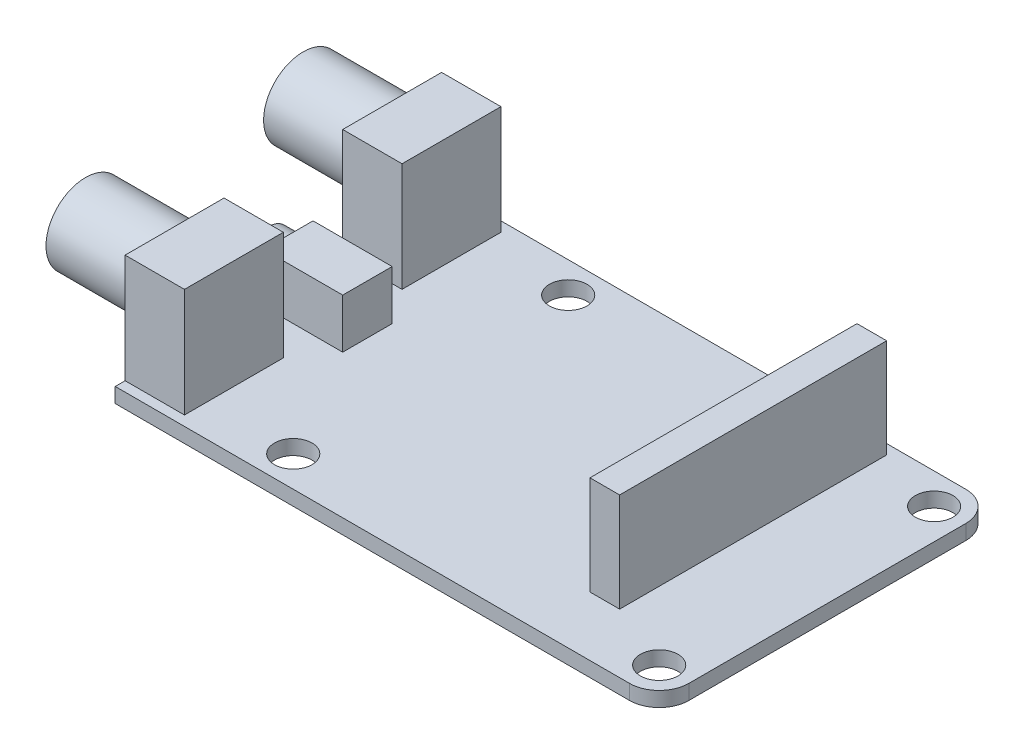
ISO-10303-21;
HEADER;
FILE_DESCRIPTION(('STEP AP214'),'2;1');
FILE_NAME('part.step','',(''),(''),'','','');
FILE_SCHEMA(('AUTOMOTIVE_DESIGN { 1 0 10303 214 1 1 1 1 }'));
ENDSEC;
DATA;
#1=APPLICATION_CONTEXT('core data for automotive mechanical design processes');
#2=APPLICATION_PROTOCOL_DEFINITION('international standard','automotive_design',2000,#1);
#3=PRODUCT_CONTEXT('',#1,'mechanical');
#4=PRODUCT('Part','Part','',(#3));
#5=PRODUCT_RELATED_PRODUCT_CATEGORY('part','',(#4));
#6=PRODUCT_DEFINITION_FORMATION('','',#4);
#7=PRODUCT_DEFINITION_CONTEXT('part definition',#1,'design');
#8=PRODUCT_DEFINITION('design','',#6,#7);
#9=PRODUCT_DEFINITION_SHAPE('','',#8);
#10=(LENGTH_UNIT() NAMED_UNIT(*) SI_UNIT(.MILLI.,.METRE.));
#11=(NAMED_UNIT(*) PLANE_ANGLE_UNIT() SI_UNIT($,.RADIAN.));
#12=(NAMED_UNIT(*) SI_UNIT($,.STERADIAN.) SOLID_ANGLE_UNIT());
#13=UNCERTAINTY_MEASURE_WITH_UNIT(LENGTH_MEASURE(1.E-05),#10,'distance_accuracy_value','');
#14=(GEOMETRIC_REPRESENTATION_CONTEXT(3) GLOBAL_UNCERTAINTY_ASSIGNED_CONTEXT((#13)) GLOBAL_UNIT_ASSIGNED_CONTEXT((#10,
#11,#12)) REPRESENTATION_CONTEXT('',''));
#15=CARTESIAN_POINT('',(0.,0.,0.));
#16=DIRECTION('',(0.,0.,1.));
#17=DIRECTION('',(1.,0.,0.));
#18=AXIS2_PLACEMENT_3D('',#15,#16,#17);
#19=CARTESIAN_POINT('',(0.,1.5,0.));
#20=DIRECTION('',(0.,1.,0.));
#21=DIRECTION('',(0.,0.,1.));
#22=AXIS2_PLACEMENT_3D('',#19,#20,#21);
#23=PLANE('',#22);
#24=CARTESIAN_POINT('',(14.9,1.5,30.9));
#25=DIRECTION('',(0.,1.,0.));
#26=DIRECTION('',(0.,0.,1.));
#27=AXIS2_PLACEMENT_3D('',#24,#25,#26);
#28=CIRCLE('',#27,1.9);
#29=CARTESIAN_POINT('',(14.9,1.5,32.8));
#30=VERTEX_POINT('',#29);
#31=EDGE_CURVE('E306',#30,#30,#28,.T.);
#32=ORIENTED_EDGE('',*,*,#31,.F.);
#33=EDGE_LOOP('',(#32));
#34=FACE_BOUND('',#33,.T.);
#35=CARTESIAN_POINT('',(14.9,1.5,3.1));
#36=DIRECTION('',(0.,1.,0.));
#37=DIRECTION('',(0.,0.,1.));
#38=AXIS2_PLACEMENT_3D('',#35,#36,#37);
#39=CIRCLE('',#38,1.9);
#40=CARTESIAN_POINT('',(14.9,1.5,5.));
#41=VERTEX_POINT('',#40);
#42=EDGE_CURVE('E312',#41,#41,#39,.T.);
#43=ORIENTED_EDGE('',*,*,#42,.F.);
#44=EDGE_LOOP('',(#43));
#45=FACE_BOUND('',#44,.T.);
#46=CARTESIAN_POINT('',(51.9,1.5,3.1));
#47=DIRECTION('',(0.,1.,0.));
#48=DIRECTION('',(0.,0.,1.));
#49=AXIS2_PLACEMENT_3D('',#46,#47,#48);
#50=CIRCLE('',#49,1.9);
#51=CARTESIAN_POINT('',(51.9,1.5,5.));
#52=VERTEX_POINT('',#51);
#53=EDGE_CURVE('E301',#52,#52,#50,.T.);
#54=ORIENTED_EDGE('',*,*,#53,.F.);
#55=EDGE_LOOP('',(#54));
#56=FACE_BOUND('',#55,.T.);
#57=CARTESIAN_POINT('',(51.9,1.5,30.9));
#58=DIRECTION('',(0.,1.,0.));
#59=DIRECTION('',(0.,0.,1.));
#60=AXIS2_PLACEMENT_3D('',#57,#58,#59);
#61=CIRCLE('',#60,1.9);
#62=CARTESIAN_POINT('',(51.9,1.5,32.8));
#63=VERTEX_POINT('',#62);
#64=EDGE_CURVE('E305',#63,#63,#61,.T.);
#65=ORIENTED_EDGE('',*,*,#64,.F.);
#66=EDGE_LOOP('',(#65));
#67=FACE_BOUND('',#66,.T.);
#68=DIRECTION('',(1.,0.,0.));
#69=VECTOR('',#68,1.);
#70=CARTESIAN_POINT('',(0.500000000000001,1.5,19.5));
#71=LINE('',#70,#69);
#72=CARTESIAN_POINT('',(0.500000000000001,1.5,19.5));
#73=VERTEX_POINT('',#72);
#74=CARTESIAN_POINT('',(8.5,1.5,19.5));
#75=VERTEX_POINT('',#74);
#76=EDGE_CURVE('E286',#73,#75,#71,.T.);
#77=ORIENTED_EDGE('',*,*,#76,.F.);
#78=DIRECTION('',(0.,0.,1.));
#79=VECTOR('',#78,1.);
#80=CARTESIAN_POINT('',(0.500000000000001,1.5,19.5));
#81=LINE('',#80,#79);
#82=CARTESIAN_POINT('',(0.5,1.5,14.5));
#83=VERTEX_POINT('',#82);
#84=EDGE_CURVE('E272',#83,#73,#81,.T.);
#85=ORIENTED_EDGE('',*,*,#84,.F.);
#86=DIRECTION('',(-1.,0.,0.));
#87=VECTOR('',#86,1.);
#88=CARTESIAN_POINT('',(0.5,1.5,14.5));
#89=LINE('',#88,#87);
#90=CARTESIAN_POINT('',(8.5,1.5,14.5));
#91=VERTEX_POINT('',#90);
#92=EDGE_CURVE('E277',#91,#83,#89,.T.);
#93=ORIENTED_EDGE('',*,*,#92,.F.);
#94=DIRECTION('',(0.,0.,-1.));
#95=VECTOR('',#94,1.);
#96=CARTESIAN_POINT('',(8.5,1.5,19.5));
#97=LINE('',#96,#95);
#98=EDGE_CURVE('E288',#75,#91,#97,.T.);
#99=ORIENTED_EDGE('',*,*,#98,.F.);
#100=EDGE_LOOP('',(#77,#85,#93,#99));
#101=FACE_BOUND('',#100,.T.);
#102=DIRECTION('',(1.,0.,0.));
#103=VECTOR('',#102,1.);
#104=CARTESIAN_POINT('',(42.,1.5,28.));
#105=LINE('',#104,#103);
#106=CARTESIAN_POINT('',(42.,1.5,28.));
#107=VERTEX_POINT('',#106);
#108=CARTESIAN_POINT('',(45.,1.5,28.));
#109=VERTEX_POINT('',#108);
#110=EDGE_CURVE('E254',#107,#109,#105,.T.);
#111=ORIENTED_EDGE('',*,*,#110,.F.);
#112=DIRECTION('',(0.,0.,1.));
#113=VECTOR('',#112,1.);
#114=CARTESIAN_POINT('',(42.,1.5,1.));
#115=LINE('',#114,#113);
#116=CARTESIAN_POINT('',(42.,1.5,1.));
#117=VERTEX_POINT('',#116);
#118=EDGE_CURVE('E240',#117,#107,#115,.T.);
#119=ORIENTED_EDGE('',*,*,#118,.F.);
#120=DIRECTION('',(-1.,0.,0.));
#121=VECTOR('',#120,1.);
#122=CARTESIAN_POINT('',(42.,1.5,1.));
#123=LINE('',#122,#121);
#124=CARTESIAN_POINT('',(45.,1.5,1.));
#125=VERTEX_POINT('',#124);
#126=EDGE_CURVE('E245',#125,#117,#123,.T.);
#127=ORIENTED_EDGE('',*,*,#126,.F.);
#128=DIRECTION('',(0.,0.,-1.));
#129=VECTOR('',#128,1.);
#130=CARTESIAN_POINT('',(45.,1.5,1.));
#131=LINE('',#130,#129);
#132=EDGE_CURVE('E256',#109,#125,#131,.T.);
#133=ORIENTED_EDGE('',*,*,#132,.F.);
#134=EDGE_LOOP('',(#111,#119,#127,#133));
#135=FACE_BOUND('',#134,.T.);
#136=DIRECTION('',(0.,0.,-1.));
#137=VECTOR('',#136,1.);
#138=CARTESIAN_POINT('',(6.,1.5,23.));
#139=LINE('',#138,#137);
#140=CARTESIAN_POINT('',(6.,1.5,33.));
#141=VERTEX_POINT('',#140);
#142=CARTESIAN_POINT('',(6.,1.5,23.));
#143=VERTEX_POINT('',#142);
#144=EDGE_CURVE('E48',#141,#143,#139,.T.);
#145=ORIENTED_EDGE('',*,*,#144,.F.);
#146=DIRECTION('',(1.,0.,0.));
#147=VECTOR('',#146,1.);
#148=CARTESIAN_POINT('',(0.,1.5,33.));
#149=LINE('',#148,#147);
#150=CARTESIAN_POINT('',(0.,1.5,33.));
#151=VERTEX_POINT('',#150);
#152=EDGE_CURVE('E437',#151,#141,#149,.T.);
#153=ORIENTED_EDGE('',*,*,#152,.F.);
#154=DIRECTION('',(0.,0.,1.));
#155=VECTOR('',#154,1.);
#156=CARTESIAN_POINT('',(0.,1.5,0.));
#157=LINE('',#156,#155);
#158=CARTESIAN_POINT('',(0.,1.5,34.));
#159=VERTEX_POINT('',#158);
#160=EDGE_CURVE('E204',#151,#159,#157,.T.);
#161=ORIENTED_EDGE('',*,*,#160,.T.);
#162=DIRECTION('',(1.,0.,0.));
#163=VECTOR('',#162,1.);
#164=CARTESIAN_POINT('',(0.,1.5,34.));
#165=LINE('',#164,#163);
#166=CARTESIAN_POINT('',(52.,1.5,34.));
#167=VERTEX_POINT('',#166);
#168=EDGE_CURVE('E328',#159,#167,#165,.T.);
#169=ORIENTED_EDGE('',*,*,#168,.T.);
#170=CARTESIAN_POINT('',(52.,1.5,31.));
#171=DIRECTION('',(0.,1.,0.));
#172=DIRECTION('',(0.,0.,1.));
#173=AXIS2_PLACEMENT_3D('',#170,#171,#172);
#174=CIRCLE('',#173,3.);
#175=CARTESIAN_POINT('',(55.,1.5,31.));
#176=VERTEX_POINT('',#175);
#177=EDGE_CURVE('E365',#167,#176,#174,.T.);
#178=ORIENTED_EDGE('',*,*,#177,.T.);
#179=DIRECTION('',(0.,0.,-1.));
#180=VECTOR('',#179,1.);
#181=CARTESIAN_POINT('',(55.,1.5,0.));
#182=LINE('',#181,#180);
#183=CARTESIAN_POINT('',(55.,1.5,3.));
#184=VERTEX_POINT('',#183);
#185=EDGE_CURVE('E332',#176,#184,#182,.T.);
#186=ORIENTED_EDGE('',*,*,#185,.T.);
#187=CARTESIAN_POINT('',(52.,1.5,3.));
#188=DIRECTION('',(0.,1.,0.));
#189=DIRECTION('',(0.,0.,1.));
#190=AXIS2_PLACEMENT_3D('',#187,#188,#189);
#191=CIRCLE('',#190,3.);
#192=CARTESIAN_POINT('',(52.,1.5,0.));
#193=VERTEX_POINT('',#192);
#194=EDGE_CURVE('E363',#184,#193,#191,.T.);
#195=ORIENTED_EDGE('',*,*,#194,.T.);
#196=DIRECTION('',(-1.,0.,0.));
#197=VECTOR('',#196,1.);
#198=CARTESIAN_POINT('',(0.,1.5,0.));
#199=LINE('',#198,#197);
#200=CARTESIAN_POINT('',(0.,1.5,0.));
#201=VERTEX_POINT('',#200);
#202=EDGE_CURVE('E335',#193,#201,#199,.T.);
#203=ORIENTED_EDGE('',*,*,#202,.T.);
#204=CARTESIAN_POINT('',(0.,1.5,0.999999999999993));
#205=VERTEX_POINT('',#204);
#206=EDGE_CURVE('E326',#201,#205,#157,.T.);
#207=ORIENTED_EDGE('',*,*,#206,.T.);
#208=DIRECTION('',(-1.,0.,0.));
#209=VECTOR('',#208,1.);
#210=CARTESIAN_POINT('',(0.,1.5,0.999999999999993));
#211=LINE('',#210,#209);
#212=CARTESIAN_POINT('',(6.,1.5,1.));
#213=VERTEX_POINT('',#212);
#214=EDGE_CURVE('E218',#213,#205,#211,.T.);
#215=ORIENTED_EDGE('',*,*,#214,.F.);
#216=DIRECTION('',(0.,0.,-1.));
#217=VECTOR('',#216,1.);
#218=CARTESIAN_POINT('',(6.,1.5,11.));
#219=LINE('',#218,#217);
#220=CARTESIAN_POINT('',(6.,1.5,11.));
#221=VERTEX_POINT('',#220);
#222=EDGE_CURVE('E208',#221,#213,#219,.T.);
#223=ORIENTED_EDGE('',*,*,#222,.F.);
#224=DIRECTION('',(1.,0.,0.));
#225=VECTOR('',#224,1.);
#226=CARTESIAN_POINT('',(0.,1.5,11.));
#227=LINE('',#226,#225);
#228=CARTESIAN_POINT('',(0.,1.5,11.));
#229=VERTEX_POINT('',#228);
#230=EDGE_CURVE('E205',#229,#221,#227,.T.);
#231=ORIENTED_EDGE('',*,*,#230,.F.);
#232=CARTESIAN_POINT('',(0.,1.5,23.));
#233=VERTEX_POINT('',#232);
#234=EDGE_CURVE('E329',#229,#233,#157,.T.);
#235=ORIENTED_EDGE('',*,*,#234,.T.);
#236=DIRECTION('',(-1.,0.,0.));
#237=VECTOR('',#236,1.);
#238=CARTESIAN_POINT('',(0.,1.5,23.));
#239=LINE('',#238,#237);
#240=EDGE_CURVE('E53',#143,#233,#239,.T.);
#241=ORIENTED_EDGE('',*,*,#240,.F.);
#242=EDGE_LOOP('',(#145,#153,#161,#169,#178,#186,#195,#203,#207,#215,#223,#231,#235,#241));
#243=FACE_BOUND('',#242,.T.);
#244=ADVANCED_FACE('F33',(#34,#45,#56,#67,#101,#135,#243),#23,.T.);
#245=CARTESIAN_POINT('',(0.,1.5,0.));
#246=DIRECTION('',(1.,0.,0.));
#247=DIRECTION('',(0.,0.,-1.));
#248=AXIS2_PLACEMENT_3D('',#245,#246,#247);
#249=PLANE('',#248);
#250=CARTESIAN_POINT('',(0.,8.3,5.99999999999999));
#251=DIRECTION('',(1.,0.,0.));
#252=DIRECTION('',(0.,0.,-1.));
#253=AXIS2_PLACEMENT_3D('',#250,#251,#252);
#254=CIRCLE('',#253,4.);
#255=CARTESIAN_POINT('',(0.,8.3,1.99999999999999));
#256=VERTEX_POINT('',#255);
#257=EDGE_CURVE('E11',#256,#256,#254,.F.);
#258=ORIENTED_EDGE('',*,*,#257,.F.);
#259=EDGE_LOOP('',(#258));
#260=FACE_BOUND('',#259,.T.);
#261=CARTESIAN_POINT('',(0.,8.3,28.));
#262=DIRECTION('',(1.,0.,0.));
#263=DIRECTION('',(0.,0.,-1.));
#264=AXIS2_PLACEMENT_3D('',#261,#262,#263);
#265=CIRCLE('',#264,4.00000000000001);
#266=CARTESIAN_POINT('',(0.,8.3,24.));
#267=VERTEX_POINT('',#266);
#268=EDGE_CURVE('E41',#267,#267,#265,.F.);
#269=ORIENTED_EDGE('',*,*,#268,.F.);
#270=EDGE_LOOP('',(#269));
#271=FACE_BOUND('',#270,.T.);
#272=DIRECTION('',(0.,0.,1.));
#273=VECTOR('',#272,1.);
#274=CARTESIAN_POINT('',(0.,0.,0.));
#275=LINE('',#274,#273);
#276=CARTESIAN_POINT('',(0.,0.,0.));
#277=VERTEX_POINT('',#276);
#278=CARTESIAN_POINT('',(0.,0.,34.));
#279=VERTEX_POINT('',#278);
#280=EDGE_CURVE('E323',#277,#279,#275,.T.);
#281=ORIENTED_EDGE('',*,*,#280,.T.);
#282=DIRECTION('',(0.,-1.,0.));
#283=VECTOR('',#282,1.);
#284=CARTESIAN_POINT('',(0.,1.5,34.));
#285=LINE('',#284,#283);
#286=EDGE_CURVE('E349',#159,#279,#285,.T.);
#287=ORIENTED_EDGE('',*,*,#286,.F.);
#288=ORIENTED_EDGE('',*,*,#160,.F.);
#289=DIRECTION('',(0.,-1.,0.));
#290=VECTOR('',#289,1.);
#291=CARTESIAN_POINT('',(0.,12.5,33.));
#292=LINE('',#291,#290);
#293=CARTESIAN_POINT('',(0.,12.5,33.));
#294=VERTEX_POINT('',#293);
#295=EDGE_CURVE('E185',#294,#151,#292,.T.);
#296=ORIENTED_EDGE('',*,*,#295,.F.);
#297=DIRECTION('',(0.,0.,1.));
#298=VECTOR('',#297,1.);
#299=CARTESIAN_POINT('',(0.,12.5,23.));
#300=LINE('',#299,#298);
#301=CARTESIAN_POINT('',(0.,12.5,23.));
#302=VERTEX_POINT('',#301);
#303=EDGE_CURVE('E191',#302,#294,#300,.T.);
#304=ORIENTED_EDGE('',*,*,#303,.F.);
#305=DIRECTION('',(0.,-1.,0.));
#306=VECTOR('',#305,1.);
#307=CARTESIAN_POINT('',(0.,12.5,23.));
#308=LINE('',#307,#306);
#309=EDGE_CURVE('E436',#302,#233,#308,.T.);
#310=ORIENTED_EDGE('',*,*,#309,.T.);
#311=ORIENTED_EDGE('',*,*,#234,.F.);
#312=DIRECTION('',(0.,-1.,0.));
#313=VECTOR('',#312,1.);
#314=CARTESIAN_POINT('',(0.,12.5,11.));
#315=LINE('',#314,#313);
#316=CARTESIAN_POINT('',(0.,12.5,11.));
#317=VERTEX_POINT('',#316);
#318=EDGE_CURVE('E237',#317,#229,#315,.T.);
#319=ORIENTED_EDGE('',*,*,#318,.F.);
#320=DIRECTION('',(0.,0.,1.));
#321=VECTOR('',#320,1.);
#322=CARTESIAN_POINT('',(0.,12.5,11.));
#323=LINE('',#322,#321);
#324=CARTESIAN_POINT('',(0.,12.5,0.999999999999993));
#325=VERTEX_POINT('',#324);
#326=EDGE_CURVE('E214',#325,#317,#323,.T.);
#327=ORIENTED_EDGE('',*,*,#326,.F.);
#328=DIRECTION('',(0.,-1.,0.));
#329=VECTOR('',#328,1.);
#330=CARTESIAN_POINT('',(0.,12.5,0.999999999999993));
#331=LINE('',#330,#329);
#332=EDGE_CURVE('E223',#325,#205,#331,.T.);
#333=ORIENTED_EDGE('',*,*,#332,.T.);
#334=ORIENTED_EDGE('',*,*,#206,.F.);
#335=DIRECTION('',(0.,-1.,0.));
#336=VECTOR('',#335,1.);
#337=CARTESIAN_POINT('',(0.,1.5,0.));
#338=LINE('',#337,#336);
#339=EDGE_CURVE('E337',#201,#277,#338,.T.);
#340=ORIENTED_EDGE('',*,*,#339,.T.);
#341=EDGE_LOOP('',(#281,#287,#288,#296,#304,#310,#311,#319,#327,#333,#334,#340));
#342=FACE_BOUND('',#341,.T.);
#343=ADVANCED_FACE('F202',(#260,#271,#342),#249,.F.);
#344=CARTESIAN_POINT('',(0.,1.5,34.));
#345=DIRECTION('',(0.,0.,-1.));
#346=DIRECTION('',(-1.,0.,0.));
#347=AXIS2_PLACEMENT_3D('',#344,#345,#346);
#348=PLANE('',#347);
#349=DIRECTION('',(1.,0.,0.));
#350=VECTOR('',#349,1.);
#351=CARTESIAN_POINT('',(0.,0.,34.));
#352=LINE('',#351,#350);
#353=CARTESIAN_POINT('',(52.,0.,34.));
#354=VERTEX_POINT('',#353);
#355=EDGE_CURVE('E339',#279,#354,#352,.T.);
#356=ORIENTED_EDGE('',*,*,#355,.T.);
#357=DIRECTION('',(0.,-1.,0.));
#358=VECTOR('',#357,1.);
#359=CARTESIAN_POINT('',(52.,1.5,34.));
#360=LINE('',#359,#358);
#361=EDGE_CURVE('E361',#354,#167,#360,.F.);
#362=ORIENTED_EDGE('',*,*,#361,.T.);
#363=ORIENTED_EDGE('',*,*,#168,.F.);
#364=ORIENTED_EDGE('',*,*,#286,.T.);
#365=EDGE_LOOP('',(#356,#362,#363,#364));
#366=FACE_BOUND('',#365,.T.);
#367=ADVANCED_FACE('F378',(#366),#348,.F.);
#368=CARTESIAN_POINT('',(55.,1.5,0.));
#369=DIRECTION('',(-1.,0.,0.));
#370=DIRECTION('',(0.,0.,1.));
#371=AXIS2_PLACEMENT_3D('',#368,#369,#370);
#372=PLANE('',#371);
#373=ORIENTED_EDGE('',*,*,#185,.F.);
#374=DIRECTION('',(0.,-1.,0.));
#375=VECTOR('',#374,1.);
#376=CARTESIAN_POINT('',(55.,1.5,31.));
#377=LINE('',#376,#375);
#378=CARTESIAN_POINT('',(55.,0.,31.));
#379=VERTEX_POINT('',#378);
#380=EDGE_CURVE('E354',#176,#379,#377,.T.);
#381=ORIENTED_EDGE('',*,*,#380,.T.);
#382=DIRECTION('',(0.,0.,-1.));
#383=VECTOR('',#382,1.);
#384=CARTESIAN_POINT('',(55.,0.,0.));
#385=LINE('',#384,#383);
#386=CARTESIAN_POINT('',(55.,0.,3.));
#387=VERTEX_POINT('',#386);
#388=EDGE_CURVE('E342',#379,#387,#385,.T.);
#389=ORIENTED_EDGE('',*,*,#388,.T.);
#390=DIRECTION('',(0.,-1.,0.));
#391=VECTOR('',#390,1.);
#392=CARTESIAN_POINT('',(55.,1.5,3.));
#393=LINE('',#392,#391);
#394=EDGE_CURVE('E352',#387,#184,#393,.F.);
#395=ORIENTED_EDGE('',*,*,#394,.T.);
#396=EDGE_LOOP('',(#373,#381,#389,#395));
#397=FACE_BOUND('',#396,.T.);
#398=ADVANCED_FACE('F385',(#397),#372,.F.);
#399=CARTESIAN_POINT('',(0.,1.5,0.));
#400=DIRECTION('',(0.,0.,1.));
#401=DIRECTION('',(1.,0.,0.));
#402=AXIS2_PLACEMENT_3D('',#399,#400,#401);
#403=PLANE('',#402);
#404=ORIENTED_EDGE('',*,*,#202,.F.);
#405=DIRECTION('',(0.,-1.,0.));
#406=VECTOR('',#405,1.);
#407=CARTESIAN_POINT('',(52.,1.5,0.));
#408=LINE('',#407,#406);
#409=CARTESIAN_POINT('',(52.,0.,0.));
#410=VERTEX_POINT('',#409);
#411=EDGE_CURVE('E367',#193,#410,#408,.T.);
#412=ORIENTED_EDGE('',*,*,#411,.T.);
#413=DIRECTION('',(-1.,0.,0.));
#414=VECTOR('',#413,1.);
#415=CARTESIAN_POINT('',(0.,0.,0.));
#416=LINE('',#415,#414);
#417=EDGE_CURVE('E345',#410,#277,#416,.T.);
#418=ORIENTED_EDGE('',*,*,#417,.T.);
#419=ORIENTED_EDGE('',*,*,#339,.F.);
#420=EDGE_LOOP('',(#404,#412,#418,#419));
#421=FACE_BOUND('',#420,.T.);
#422=ADVANCED_FACE('F418',(#421),#403,.F.);
#423=CARTESIAN_POINT('',(0.,0.,0.));
#424=DIRECTION('',(0.,1.,0.));
#425=DIRECTION('',(0.,0.,1.));
#426=AXIS2_PLACEMENT_3D('',#423,#424,#425);
#427=PLANE('',#426);
#428=CARTESIAN_POINT('',(14.9,0.,30.9));
#429=DIRECTION('',(0.,1.,0.));
#430=DIRECTION('',(0.,0.,1.));
#431=AXIS2_PLACEMENT_3D('',#428,#429,#430);
#432=CIRCLE('',#431,1.9);
#433=CARTESIAN_POINT('',(14.9,0.,32.8));
#434=VERTEX_POINT('',#433);
#435=EDGE_CURVE('E302',#434,#434,#432,.T.);
#436=ORIENTED_EDGE('',*,*,#435,.T.);
#437=EDGE_LOOP('',(#436));
#438=FACE_BOUND('',#437,.T.);
#439=CARTESIAN_POINT('',(14.9,0.,3.1));
#440=DIRECTION('',(0.,1.,0.));
#441=DIRECTION('',(0.,0.,1.));
#442=AXIS2_PLACEMENT_3D('',#439,#440,#441);
#443=CIRCLE('',#442,1.9);
#444=CARTESIAN_POINT('',(14.9,0.,5.));
#445=VERTEX_POINT('',#444);
#446=EDGE_CURVE('E309',#445,#445,#443,.T.);
#447=ORIENTED_EDGE('',*,*,#446,.T.);
#448=EDGE_LOOP('',(#447));
#449=FACE_BOUND('',#448,.T.);
#450=CARTESIAN_POINT('',(51.9,0.,3.1));
#451=DIRECTION('',(0.,1.,0.));
#452=DIRECTION('',(0.,0.,1.));
#453=AXIS2_PLACEMENT_3D('',#450,#451,#452);
#454=CIRCLE('',#453,1.9);
#455=CARTESIAN_POINT('',(51.9,0.,5.));
#456=VERTEX_POINT('',#455);
#457=EDGE_CURVE('E315',#456,#456,#454,.T.);
#458=ORIENTED_EDGE('',*,*,#457,.T.);
#459=EDGE_LOOP('',(#458));
#460=FACE_BOUND('',#459,.T.);
#461=CARTESIAN_POINT('',(51.9,0.,30.9));
#462=DIRECTION('',(0.,1.,0.));
#463=DIRECTION('',(0.,0.,1.));
#464=AXIS2_PLACEMENT_3D('',#461,#462,#463);
#465=CIRCLE('',#464,1.9);
#466=CARTESIAN_POINT('',(51.9,0.,32.8));
#467=VERTEX_POINT('',#466);
#468=EDGE_CURVE('E320',#467,#467,#465,.T.);
#469=ORIENTED_EDGE('',*,*,#468,.T.);
#470=EDGE_LOOP('',(#469));
#471=FACE_BOUND('',#470,.T.);
#472=ORIENTED_EDGE('',*,*,#388,.F.);
#473=CARTESIAN_POINT('',(52.,0.,31.));
#474=DIRECTION('',(0.,1.,0.));
#475=DIRECTION('',(0.,0.,1.));
#476=AXIS2_PLACEMENT_3D('',#473,#474,#475);
#477=CIRCLE('',#476,3.);
#478=EDGE_CURVE('E359',#379,#354,#477,.F.);
#479=ORIENTED_EDGE('',*,*,#478,.T.);
#480=ORIENTED_EDGE('',*,*,#355,.F.);
#481=ORIENTED_EDGE('',*,*,#280,.F.);
#482=ORIENTED_EDGE('',*,*,#417,.F.);
#483=CARTESIAN_POINT('',(52.,0.,3.));
#484=DIRECTION('',(0.,1.,0.));
#485=DIRECTION('',(0.,0.,1.));
#486=AXIS2_PLACEMENT_3D('',#483,#484,#485);
#487=CIRCLE('',#486,3.);
#488=EDGE_CURVE('E357',#410,#387,#487,.F.);
#489=ORIENTED_EDGE('',*,*,#488,.T.);
#490=EDGE_LOOP('',(#472,#479,#480,#481,#482,#489));
#491=FACE_BOUND('',#490,.T.);
#492=ADVANCED_FACE('F439',(#438,#449,#460,#471,#491),#427,.F.);
#493=CARTESIAN_POINT('',(51.9,0.,30.9));
#494=DIRECTION('',(0.,1.,0.));
#495=DIRECTION('',(0.,0.,1.));
#496=AXIS2_PLACEMENT_3D('',#493,#494,#495);
#497=CYLINDRICAL_SURFACE('',#496,1.9);
#498=ORIENTED_EDGE('',*,*,#468,.F.);
#499=EDGE_LOOP('',(#498));
#500=FACE_BOUND('',#499,.T.);
#501=ORIENTED_EDGE('',*,*,#64,.T.);
#502=EDGE_LOOP('',(#501));
#503=FACE_BOUND('',#502,.T.);
#504=ADVANCED_FACE('F441',(#500,#503),#497,.F.);
#505=CARTESIAN_POINT('',(51.9,0.,3.1));
#506=DIRECTION('',(0.,1.,0.));
#507=DIRECTION('',(0.,0.,1.));
#508=AXIS2_PLACEMENT_3D('',#505,#506,#507);
#509=CYLINDRICAL_SURFACE('',#508,1.9);
#510=ORIENTED_EDGE('',*,*,#457,.F.);
#511=EDGE_LOOP('',(#510));
#512=FACE_BOUND('',#511,.T.);
#513=ORIENTED_EDGE('',*,*,#53,.T.);
#514=EDGE_LOOP('',(#513));
#515=FACE_BOUND('',#514,.T.);
#516=ADVANCED_FACE('F448',(#512,#515),#509,.F.);
#517=CARTESIAN_POINT('',(14.9,0.,3.1));
#518=DIRECTION('',(0.,1.,0.));
#519=DIRECTION('',(0.,0.,1.));
#520=AXIS2_PLACEMENT_3D('',#517,#518,#519);
#521=CYLINDRICAL_SURFACE('',#520,1.9);
#522=ORIENTED_EDGE('',*,*,#446,.F.);
#523=EDGE_LOOP('',(#522));
#524=FACE_BOUND('',#523,.T.);
#525=ORIENTED_EDGE('',*,*,#42,.T.);
#526=EDGE_LOOP('',(#525));
#527=FACE_BOUND('',#526,.T.);
#528=ADVANCED_FACE('F402',(#524,#527),#521,.F.);
#529=CARTESIAN_POINT('',(14.9,0.,30.9));
#530=DIRECTION('',(0.,1.,0.));
#531=DIRECTION('',(0.,0.,1.));
#532=AXIS2_PLACEMENT_3D('',#529,#530,#531);
#533=CYLINDRICAL_SURFACE('',#532,1.9);
#534=ORIENTED_EDGE('',*,*,#435,.F.);
#535=EDGE_LOOP('',(#534));
#536=FACE_BOUND('',#535,.T.);
#537=ORIENTED_EDGE('',*,*,#31,.T.);
#538=EDGE_LOOP('',(#537));
#539=FACE_BOUND('',#538,.T.);
#540=ADVANCED_FACE('F394',(#536,#539),#533,.F.);
#541=CARTESIAN_POINT('',(52.,1.5,31.));
#542=DIRECTION('',(0.,-1.,0.));
#543=DIRECTION('',(0.,0.,-1.));
#544=AXIS2_PLACEMENT_3D('',#541,#542,#543);
#545=CYLINDRICAL_SURFACE('',#544,3.);
#546=ORIENTED_EDGE('',*,*,#177,.F.);
#547=ORIENTED_EDGE('',*,*,#361,.F.);
#548=ORIENTED_EDGE('',*,*,#478,.F.);
#549=ORIENTED_EDGE('',*,*,#380,.F.);
#550=EDGE_LOOP('',(#546,#547,#548,#549));
#551=FACE_BOUND('',#550,.T.);
#552=ADVANCED_FACE('F392',(#551),#545,.T.);
#553=CARTESIAN_POINT('',(52.,1.5,3.));
#554=DIRECTION('',(0.,-1.,0.));
#555=DIRECTION('',(0.,0.,-1.));
#556=AXIS2_PLACEMENT_3D('',#553,#554,#555);
#557=CYLINDRICAL_SURFACE('',#556,3.);
#558=ORIENTED_EDGE('',*,*,#194,.F.);
#559=ORIENTED_EDGE('',*,*,#394,.F.);
#560=ORIENTED_EDGE('',*,*,#488,.F.);
#561=ORIENTED_EDGE('',*,*,#411,.F.);
#562=EDGE_LOOP('',(#558,#559,#560,#561));
#563=FACE_BOUND('',#562,.T.);
#564=ADVANCED_FACE('F35',(#563),#557,.T.);
#565=CARTESIAN_POINT('',(0.500000000000001,6.5,19.5));
#566=DIRECTION('',(1.,0.,0.));
#567=DIRECTION('',(0.,0.,-1.));
#568=AXIS2_PLACEMENT_3D('',#565,#566,#567);
#569=PLANE('',#568);
#570=CARTESIAN_POINT('',(0.5,4.,17.));
#571=DIRECTION('',(1.,0.,0.));
#572=DIRECTION('',(0.,0.,-1.));
#573=AXIS2_PLACEMENT_3D('',#570,#571,#572);
#574=CIRCLE('',#573,2.25);
#575=CARTESIAN_POINT('',(0.5,4.,14.75));
#576=VERTEX_POINT('',#575);
#577=EDGE_CURVE('E370',#576,#576,#574,.F.);
#578=ORIENTED_EDGE('',*,*,#577,.F.);
#579=EDGE_LOOP('',(#578));
#580=FACE_BOUND('',#579,.T.);
#581=ORIENTED_EDGE('',*,*,#84,.T.);
#582=DIRECTION('',(0.,-1.,0.));
#583=VECTOR('',#582,1.);
#584=CARTESIAN_POINT('',(0.500000000000001,6.5,19.5));
#585=LINE('',#584,#583);
#586=CARTESIAN_POINT('',(0.500000000000001,6.5,19.5));
#587=VERTEX_POINT('',#586);
#588=EDGE_CURVE('E299',#587,#73,#585,.T.);
#589=ORIENTED_EDGE('',*,*,#588,.F.);
#590=DIRECTION('',(0.,0.,1.));
#591=VECTOR('',#590,1.);
#592=CARTESIAN_POINT('',(0.500000000000001,6.5,19.5));
#593=LINE('',#592,#591);
#594=CARTESIAN_POINT('',(0.5,6.5,14.5));
#595=VERTEX_POINT('',#594);
#596=EDGE_CURVE('E273',#595,#587,#593,.T.);
#597=ORIENTED_EDGE('',*,*,#596,.F.);
#598=DIRECTION('',(0.,-1.,0.));
#599=VECTOR('',#598,1.);
#600=CARTESIAN_POINT('',(0.5,6.5,14.5));
#601=LINE('',#600,#599);
#602=EDGE_CURVE('E283',#595,#83,#601,.T.);
#603=ORIENTED_EDGE('',*,*,#602,.T.);
#604=EDGE_LOOP('',(#581,#589,#597,#603));
#605=FACE_BOUND('',#604,.T.);
#606=ADVANCED_FACE('F400',(#580,#605),#569,.F.);
#607=CARTESIAN_POINT('',(0.500000000000001,6.5,19.5));
#608=DIRECTION('',(0.,0.,-1.));
#609=DIRECTION('',(-1.,0.,0.));
#610=AXIS2_PLACEMENT_3D('',#607,#608,#609);
#611=PLANE('',#610);
#612=ORIENTED_EDGE('',*,*,#76,.T.);
#613=DIRECTION('',(0.,-1.,0.));
#614=VECTOR('',#613,1.);
#615=CARTESIAN_POINT('',(8.5,6.5,19.5));
#616=LINE('',#615,#614);
#617=CARTESIAN_POINT('',(8.5,6.5,19.5));
#618=VERTEX_POINT('',#617);
#619=EDGE_CURVE('E296',#618,#75,#616,.T.);
#620=ORIENTED_EDGE('',*,*,#619,.F.);
#621=DIRECTION('',(1.,0.,0.));
#622=VECTOR('',#621,1.);
#623=CARTESIAN_POINT('',(0.500000000000001,6.5,19.5));
#624=LINE('',#623,#622);
#625=EDGE_CURVE('E276',#587,#618,#624,.T.);
#626=ORIENTED_EDGE('',*,*,#625,.F.);
#627=ORIENTED_EDGE('',*,*,#588,.T.);
#628=EDGE_LOOP('',(#612,#620,#626,#627));
#629=FACE_BOUND('',#628,.T.);
#630=ADVANCED_FACE('F485',(#629),#611,.F.);
#631=CARTESIAN_POINT('',(8.5,6.5,19.5));
#632=DIRECTION('',(-1.,0.,0.));
#633=DIRECTION('',(0.,0.,1.));
#634=AXIS2_PLACEMENT_3D('',#631,#632,#633);
#635=PLANE('',#634);
#636=ORIENTED_EDGE('',*,*,#98,.T.);
#637=DIRECTION('',(0.,-1.,0.));
#638=VECTOR('',#637,1.);
#639=CARTESIAN_POINT('',(8.5,6.5,14.5));
#640=LINE('',#639,#638);
#641=CARTESIAN_POINT('',(8.5,6.5,14.5));
#642=VERTEX_POINT('',#641);
#643=EDGE_CURVE('E294',#642,#91,#640,.T.);
#644=ORIENTED_EDGE('',*,*,#643,.F.);
#645=DIRECTION('',(0.,0.,-1.));
#646=VECTOR('',#645,1.);
#647=CARTESIAN_POINT('',(8.5,6.5,19.5));
#648=LINE('',#647,#646);
#649=EDGE_CURVE('E279',#618,#642,#648,.T.);
#650=ORIENTED_EDGE('',*,*,#649,.F.);
#651=ORIENTED_EDGE('',*,*,#619,.T.);
#652=EDGE_LOOP('',(#636,#644,#650,#651));
#653=FACE_BOUND('',#652,.T.);
#654=ADVANCED_FACE('F490',(#653),#635,.F.);
#655=CARTESIAN_POINT('',(0.5,6.5,14.5));
#656=DIRECTION('',(0.,0.,1.));
#657=DIRECTION('',(1.,0.,0.));
#658=AXIS2_PLACEMENT_3D('',#655,#656,#657);
#659=PLANE('',#658);
#660=ORIENTED_EDGE('',*,*,#92,.T.);
#661=ORIENTED_EDGE('',*,*,#602,.F.);
#662=DIRECTION('',(-1.,0.,0.));
#663=VECTOR('',#662,1.);
#664=CARTESIAN_POINT('',(0.5,6.5,14.5));
#665=LINE('',#664,#663);
#666=EDGE_CURVE('E281',#642,#595,#665,.T.);
#667=ORIENTED_EDGE('',*,*,#666,.F.);
#668=ORIENTED_EDGE('',*,*,#643,.T.);
#669=EDGE_LOOP('',(#660,#661,#667,#668));
#670=FACE_BOUND('',#669,.T.);
#671=ADVANCED_FACE('F500',(#670),#659,.F.);
#672=CARTESIAN_POINT('',(0.,6.5,0.));
#673=DIRECTION('',(0.,-1.,0.));
#674=DIRECTION('',(0.,0.,-1.));
#675=AXIS2_PLACEMENT_3D('',#672,#673,#674);
#676=PLANE('',#675);
#677=ORIENTED_EDGE('',*,*,#596,.T.);
#678=ORIENTED_EDGE('',*,*,#625,.T.);
#679=ORIENTED_EDGE('',*,*,#649,.T.);
#680=ORIENTED_EDGE('',*,*,#666,.T.);
#681=EDGE_LOOP('',(#677,#678,#679,#680));
#682=FACE_BOUND('',#681,.T.);
#683=ADVANCED_FACE('F510',(#682),#676,.F.);
#684=CARTESIAN_POINT('',(-1.5,4.,17.));
#685=DIRECTION('',(1.,0.,0.));
#686=DIRECTION('',(0.,0.,-1.));
#687=AXIS2_PLACEMENT_3D('',#684,#685,#686);
#688=CYLINDRICAL_SURFACE('',#687,2.25);
#689=CARTESIAN_POINT('',(-1.5,4.,17.));
#690=DIRECTION('',(-1.,0.,0.));
#691=DIRECTION('',(0.,0.,1.));
#692=AXIS2_PLACEMENT_3D('',#689,#690,#691);
#693=CIRCLE('',#692,2.25);
#694=CARTESIAN_POINT('',(-1.5,4.,19.25));
#695=VERTEX_POINT('',#694);
#696=EDGE_CURVE('E269',#695,#695,#693,.T.);
#697=ORIENTED_EDGE('',*,*,#696,.F.);
#698=EDGE_LOOP('',(#697));
#699=FACE_BOUND('',#698,.T.);
#700=ORIENTED_EDGE('',*,*,#577,.T.);
#701=EDGE_LOOP('',(#700));
#702=FACE_BOUND('',#701,.T.);
#703=ADVANCED_FACE('F520',(#699,#702),#688,.T.);
#704=CARTESIAN_POINT('',(-1.5,4.,17.));
#705=DIRECTION('',(-1.,0.,0.));
#706=DIRECTION('',(0.,0.,1.));
#707=AXIS2_PLACEMENT_3D('',#704,#705,#706);
#708=PLANE('',#707);
#709=ORIENTED_EDGE('',*,*,#696,.T.);
#710=EDGE_LOOP('',(#709));
#711=FACE_BOUND('',#710,.T.);
#712=ADVANCED_FACE('F537',(#711),#708,.T.);
#713=CARTESIAN_POINT('',(42.,11.5,1.));
#714=DIRECTION('',(1.,0.,0.));
#715=DIRECTION('',(0.,0.,-1.));
#716=AXIS2_PLACEMENT_3D('',#713,#714,#715);
#717=PLANE('',#716);
#718=ORIENTED_EDGE('',*,*,#118,.T.);
#719=DIRECTION('',(0.,-1.,0.));
#720=VECTOR('',#719,1.);
#721=CARTESIAN_POINT('',(42.,11.5,28.));
#722=LINE('',#721,#720);
#723=CARTESIAN_POINT('',(42.,11.5,28.));
#724=VERTEX_POINT('',#723);
#725=EDGE_CURVE('E267',#724,#107,#722,.T.);
#726=ORIENTED_EDGE('',*,*,#725,.F.);
#727=DIRECTION('',(0.,0.,1.));
#728=VECTOR('',#727,1.);
#729=CARTESIAN_POINT('',(42.,11.5,1.));
#730=LINE('',#729,#728);
#731=CARTESIAN_POINT('',(42.,11.5,1.));
#732=VERTEX_POINT('',#731);
#733=EDGE_CURVE('E241',#732,#724,#730,.T.);
#734=ORIENTED_EDGE('',*,*,#733,.F.);
#735=DIRECTION('',(0.,-1.,0.));
#736=VECTOR('',#735,1.);
#737=CARTESIAN_POINT('',(42.,11.5,1.));
#738=LINE('',#737,#736);
#739=EDGE_CURVE('E251',#732,#117,#738,.T.);
#740=ORIENTED_EDGE('',*,*,#739,.T.);
#741=EDGE_LOOP('',(#718,#726,#734,#740));
#742=FACE_BOUND('',#741,.T.);
#743=ADVANCED_FACE('F547',(#742),#717,.F.);
#744=CARTESIAN_POINT('',(42.,11.5,28.));
#745=DIRECTION('',(0.,0.,-1.));
#746=DIRECTION('',(-1.,0.,0.));
#747=AXIS2_PLACEMENT_3D('',#744,#745,#746);
#748=PLANE('',#747);
#749=ORIENTED_EDGE('',*,*,#110,.T.);
#750=DIRECTION('',(0.,-1.,0.));
#751=VECTOR('',#750,1.);
#752=CARTESIAN_POINT('',(45.,11.5,28.));
#753=LINE('',#752,#751);
#754=CARTESIAN_POINT('',(45.,11.5,28.));
#755=VERTEX_POINT('',#754);
#756=EDGE_CURVE('E264',#755,#109,#753,.T.);
#757=ORIENTED_EDGE('',*,*,#756,.F.);
#758=DIRECTION('',(1.,0.,0.));
#759=VECTOR('',#758,1.);
#760=CARTESIAN_POINT('',(42.,11.5,28.));
#761=LINE('',#760,#759);
#762=EDGE_CURVE('E244',#724,#755,#761,.T.);
#763=ORIENTED_EDGE('',*,*,#762,.F.);
#764=ORIENTED_EDGE('',*,*,#725,.T.);
#765=EDGE_LOOP('',(#749,#757,#763,#764));
#766=FACE_BOUND('',#765,.T.);
#767=ADVANCED_FACE('F557',(#766),#748,.F.);
#768=CARTESIAN_POINT('',(45.,11.5,1.));
#769=DIRECTION('',(-1.,0.,0.));
#770=DIRECTION('',(0.,0.,1.));
#771=AXIS2_PLACEMENT_3D('',#768,#769,#770);
#772=PLANE('',#771);
#773=ORIENTED_EDGE('',*,*,#132,.T.);
#774=DIRECTION('',(0.,-1.,0.));
#775=VECTOR('',#774,1.);
#776=CARTESIAN_POINT('',(45.,11.5,1.));
#777=LINE('',#776,#775);
#778=CARTESIAN_POINT('',(45.,11.5,1.));
#779=VERTEX_POINT('',#778);
#780=EDGE_CURVE('E262',#779,#125,#777,.T.);
#781=ORIENTED_EDGE('',*,*,#780,.F.);
#782=DIRECTION('',(0.,0.,-1.));
#783=VECTOR('',#782,1.);
#784=CARTESIAN_POINT('',(45.,11.5,1.));
#785=LINE('',#784,#783);
#786=EDGE_CURVE('E247',#755,#779,#785,.T.);
#787=ORIENTED_EDGE('',*,*,#786,.F.);
#788=ORIENTED_EDGE('',*,*,#756,.T.);
#789=EDGE_LOOP('',(#773,#781,#787,#788));
#790=FACE_BOUND('',#789,.T.);
#791=ADVANCED_FACE('F567',(#790),#772,.F.);
#792=CARTESIAN_POINT('',(42.,11.5,1.));
#793=DIRECTION('',(0.,0.,1.));
#794=DIRECTION('',(1.,0.,0.));
#795=AXIS2_PLACEMENT_3D('',#792,#793,#794);
#796=PLANE('',#795);
#797=ORIENTED_EDGE('',*,*,#126,.T.);
#798=ORIENTED_EDGE('',*,*,#739,.F.);
#799=DIRECTION('',(-1.,0.,0.));
#800=VECTOR('',#799,1.);
#801=CARTESIAN_POINT('',(42.,11.5,1.));
#802=LINE('',#801,#800);
#803=EDGE_CURVE('E249',#779,#732,#802,.T.);
#804=ORIENTED_EDGE('',*,*,#803,.F.);
#805=ORIENTED_EDGE('',*,*,#780,.T.);
#806=EDGE_LOOP('',(#797,#798,#804,#805));
#807=FACE_BOUND('',#806,.T.);
#808=ADVANCED_FACE('F577',(#807),#796,.F.);
#809=CARTESIAN_POINT('',(0.,11.5,0.));
#810=DIRECTION('',(0.,1.,0.));
#811=DIRECTION('',(0.,0.,1.));
#812=AXIS2_PLACEMENT_3D('',#809,#810,#811);
#813=PLANE('',#812);
#814=ORIENTED_EDGE('',*,*,#733,.T.);
#815=ORIENTED_EDGE('',*,*,#762,.T.);
#816=ORIENTED_EDGE('',*,*,#786,.T.);
#817=ORIENTED_EDGE('',*,*,#803,.T.);
#818=EDGE_LOOP('',(#814,#815,#816,#817));
#819=FACE_BOUND('',#818,.T.);
#820=ADVANCED_FACE('F587',(#819),#813,.T.);
#821=CARTESIAN_POINT('',(0.,12.5,11.));
#822=DIRECTION('',(0.,0.,-1.));
#823=DIRECTION('',(-1.,0.,0.));
#824=AXIS2_PLACEMENT_3D('',#821,#822,#823);
#825=PLANE('',#824);
#826=ORIENTED_EDGE('',*,*,#230,.T.);
#827=DIRECTION('',(0.,-1.,0.));
#828=VECTOR('',#827,1.);
#829=CARTESIAN_POINT('',(6.,12.5,11.));
#830=LINE('',#829,#828);
#831=CARTESIAN_POINT('',(6.,12.5,11.));
#832=VERTEX_POINT('',#831);
#833=EDGE_CURVE('E234',#832,#221,#830,.T.);
#834=ORIENTED_EDGE('',*,*,#833,.F.);
#835=DIRECTION('',(1.,0.,0.));
#836=VECTOR('',#835,1.);
#837=CARTESIAN_POINT('',(0.,12.5,11.));
#838=LINE('',#837,#836);
#839=EDGE_CURVE('E217',#317,#832,#838,.T.);
#840=ORIENTED_EDGE('',*,*,#839,.F.);
#841=ORIENTED_EDGE('',*,*,#318,.T.);
#842=EDGE_LOOP('',(#826,#834,#840,#841));
#843=FACE_BOUND('',#842,.T.);
#844=ADVANCED_FACE('F434',(#843),#825,.F.);
#845=CARTESIAN_POINT('',(6.,12.5,11.));
#846=DIRECTION('',(-1.,0.,0.));
#847=DIRECTION('',(0.,0.,1.));
#848=AXIS2_PLACEMENT_3D('',#845,#846,#847);
#849=PLANE('',#848);
#850=ORIENTED_EDGE('',*,*,#222,.T.);
#851=DIRECTION('',(0.,-1.,0.));
#852=VECTOR('',#851,1.);
#853=CARTESIAN_POINT('',(6.,12.5,1.));
#854=LINE('',#853,#852);
#855=CARTESIAN_POINT('',(6.,12.5,1.));
#856=VERTEX_POINT('',#855);
#857=EDGE_CURVE('E231',#856,#213,#854,.T.);
#858=ORIENTED_EDGE('',*,*,#857,.F.);
#859=DIRECTION('',(0.,0.,-1.));
#860=VECTOR('',#859,1.);
#861=CARTESIAN_POINT('',(6.,12.5,11.));
#862=LINE('',#861,#860);
#863=EDGE_CURVE('E220',#832,#856,#862,.T.);
#864=ORIENTED_EDGE('',*,*,#863,.F.);
#865=ORIENTED_EDGE('',*,*,#833,.T.);
#866=EDGE_LOOP('',(#850,#858,#864,#865));
#867=FACE_BOUND('',#866,.T.);
#868=ADVANCED_FACE('F430',(#867),#849,.F.);
#869=CARTESIAN_POINT('',(0.,12.5,0.999999999999993));
#870=DIRECTION('',(0.,0.,1.));
#871=DIRECTION('',(1.,0.,0.));
#872=AXIS2_PLACEMENT_3D('',#869,#870,#871);
#873=PLANE('',#872);
#874=ORIENTED_EDGE('',*,*,#214,.T.);
#875=ORIENTED_EDGE('',*,*,#332,.F.);
#876=DIRECTION('',(-1.,0.,0.));
#877=VECTOR('',#876,1.);
#878=CARTESIAN_POINT('',(0.,12.5,0.999999999999993));
#879=LINE('',#878,#877);
#880=EDGE_CURVE('E222',#856,#325,#879,.T.);
#881=ORIENTED_EDGE('',*,*,#880,.F.);
#882=ORIENTED_EDGE('',*,*,#857,.T.);
#883=EDGE_LOOP('',(#874,#875,#881,#882));
#884=FACE_BOUND('',#883,.T.);
#885=ADVANCED_FACE('F425',(#884),#873,.F.);
#886=CARTESIAN_POINT('',(0.,12.5,0.));
#887=DIRECTION('',(0.,-1.,0.));
#888=DIRECTION('',(0.,0.,-1.));
#889=AXIS2_PLACEMENT_3D('',#886,#887,#888);
#890=PLANE('',#889);
#891=ORIENTED_EDGE('',*,*,#326,.T.);
#892=ORIENTED_EDGE('',*,*,#839,.T.);
#893=ORIENTED_EDGE('',*,*,#863,.T.);
#894=ORIENTED_EDGE('',*,*,#880,.T.);
#895=EDGE_LOOP('',(#891,#892,#893,#894));
#896=FACE_BOUND('',#895,.T.);
#897=ADVANCED_FACE('F630',(#896),#890,.F.);
#898=CARTESIAN_POINT('',(0.,12.5,33.));
#899=DIRECTION('',(0.,0.,-1.));
#900=DIRECTION('',(-1.,0.,0.));
#901=AXIS2_PLACEMENT_3D('',#898,#899,#900);
#902=PLANE('',#901);
#903=ORIENTED_EDGE('',*,*,#152,.T.);
#904=DIRECTION('',(0.,-1.,0.));
#905=VECTOR('',#904,1.);
#906=CARTESIAN_POINT('',(6.,12.5,33.));
#907=LINE('',#906,#905);
#908=CARTESIAN_POINT('',(6.,12.5,33.));
#909=VERTEX_POINT('',#908);
#910=EDGE_CURVE('E187',#909,#141,#907,.T.);
#911=ORIENTED_EDGE('',*,*,#910,.F.);
#912=DIRECTION('',(1.,0.,0.));
#913=VECTOR('',#912,1.);
#914=CARTESIAN_POINT('',(0.,12.5,33.));
#915=LINE('',#914,#913);
#916=EDGE_CURVE('E181',#294,#909,#915,.T.);
#917=ORIENTED_EDGE('',*,*,#916,.F.);
#918=ORIENTED_EDGE('',*,*,#295,.T.);
#919=EDGE_LOOP('',(#903,#911,#917,#918));
#920=FACE_BOUND('',#919,.T.);
#921=ADVANCED_FACE('F183',(#920),#902,.F.);
#922=CARTESIAN_POINT('',(6.,12.5,23.));
#923=DIRECTION('',(-1.,0.,0.));
#924=DIRECTION('',(0.,0.,1.));
#925=AXIS2_PLACEMENT_3D('',#922,#923,#924);
#926=PLANE('',#925);
#927=ORIENTED_EDGE('',*,*,#144,.T.);
#928=DIRECTION('',(0.,-1.,0.));
#929=VECTOR('',#928,1.);
#930=CARTESIAN_POINT('',(6.,12.5,23.));
#931=LINE('',#930,#929);
#932=CARTESIAN_POINT('',(6.,12.5,23.));
#933=VERTEX_POINT('',#932);
#934=EDGE_CURVE('E210',#933,#143,#931,.T.);
#935=ORIENTED_EDGE('',*,*,#934,.F.);
#936=DIRECTION('',(0.,0.,-1.));
#937=VECTOR('',#936,1.);
#938=CARTESIAN_POINT('',(6.,12.5,23.));
#939=LINE('',#938,#937);
#940=EDGE_CURVE('E190',#909,#933,#939,.T.);
#941=ORIENTED_EDGE('',*,*,#940,.F.);
#942=ORIENTED_EDGE('',*,*,#910,.T.);
#943=EDGE_LOOP('',(#927,#935,#941,#942));
#944=FACE_BOUND('',#943,.T.);
#945=ADVANCED_FACE('F648',(#944),#926,.F.);
#946=CARTESIAN_POINT('',(0.,12.5,23.));
#947=DIRECTION('',(0.,0.,1.));
#948=DIRECTION('',(1.,0.,0.));
#949=AXIS2_PLACEMENT_3D('',#946,#947,#948);
#950=PLANE('',#949);
#951=ORIENTED_EDGE('',*,*,#240,.T.);
#952=ORIENTED_EDGE('',*,*,#309,.F.);
#953=DIRECTION('',(-1.,0.,0.));
#954=VECTOR('',#953,1.);
#955=CARTESIAN_POINT('',(0.,12.5,23.));
#956=LINE('',#955,#954);
#957=EDGE_CURVE('E196',#933,#302,#956,.T.);
#958=ORIENTED_EDGE('',*,*,#957,.F.);
#959=ORIENTED_EDGE('',*,*,#934,.T.);
#960=EDGE_LOOP('',(#951,#952,#958,#959));
#961=FACE_BOUND('',#960,.T.);
#962=ADVANCED_FACE('F657',(#961),#950,.F.);
#963=CARTESIAN_POINT('',(0.,12.5,0.));
#964=DIRECTION('',(0.,1.,0.));
#965=DIRECTION('',(0.,0.,1.));
#966=AXIS2_PLACEMENT_3D('',#963,#964,#965);
#967=PLANE('',#966);
#968=ORIENTED_EDGE('',*,*,#303,.T.);
#969=ORIENTED_EDGE('',*,*,#916,.T.);
#970=ORIENTED_EDGE('',*,*,#940,.T.);
#971=ORIENTED_EDGE('',*,*,#957,.T.);
#972=EDGE_LOOP('',(#968,#969,#970,#971));
#973=FACE_BOUND('',#972,.T.);
#974=ADVANCED_FACE('F194',(#973),#967,.T.);
#975=CARTESIAN_POINT('',(-8.99999999999999,8.3,28.));
#976=DIRECTION('',(1.,0.,0.));
#977=DIRECTION('',(0.,0.,-1.));
#978=AXIS2_PLACEMENT_3D('',#975,#976,#977);
#979=CYLINDRICAL_SURFACE('',#978,4.00000000000001);
#980=CARTESIAN_POINT('',(-8.99999999999999,8.3,28.));
#981=DIRECTION('',(-1.,0.,0.));
#982=DIRECTION('',(0.,0.,1.));
#983=AXIS2_PLACEMENT_3D('',#980,#981,#982);
#984=CIRCLE('',#983,4.00000000000001);
#985=CARTESIAN_POINT('',(-8.99999999999999,8.3,32.));
#986=VERTEX_POINT('',#985);
#987=EDGE_CURVE('E802',#986,#986,#984,.T.);
#988=ORIENTED_EDGE('',*,*,#987,.F.);
#989=EDGE_LOOP('',(#988));
#990=FACE_BOUND('',#989,.T.);
#991=ORIENTED_EDGE('',*,*,#268,.T.);
#992=EDGE_LOOP('',(#991));
#993=FACE_BOUND('',#992,.T.);
#994=ADVANCED_FACE('F375',(#990,#993),#979,.T.);
#995=CARTESIAN_POINT('',(-8.99999999999999,8.3,28.));
#996=DIRECTION('',(-1.,0.,0.));
#997=DIRECTION('',(0.,0.,1.));
#998=AXIS2_PLACEMENT_3D('',#995,#996,#997);
#999=PLANE('',#998);
#1000=ORIENTED_EDGE('',*,*,#987,.T.);
#1001=EDGE_LOOP('',(#1000));
#1002=FACE_BOUND('',#1001,.T.);
#1003=ADVANCED_FACE('F687',(#1002),#999,.T.);
#1004=CARTESIAN_POINT('',(-9.,8.3,6.));
#1005=DIRECTION('',(1.,0.,0.));
#1006=DIRECTION('',(0.,0.,-1.));
#1007=AXIS2_PLACEMENT_3D('',#1004,#1005,#1006);
#1008=CYLINDRICAL_SURFACE('',#1007,4.);
#1009=CARTESIAN_POINT('',(-9.,8.3,6.));
#1010=DIRECTION('',(-1.,0.,0.));
#1011=DIRECTION('',(0.,0.,1.));
#1012=AXIS2_PLACEMENT_3D('',#1009,#1010,#1011);
#1013=CIRCLE('',#1012,4.);
#1014=CARTESIAN_POINT('',(-9.,8.3,10.));
#1015=VERTEX_POINT('',#1014);
#1016=EDGE_CURVE('E801',#1015,#1015,#1013,.T.);
#1017=ORIENTED_EDGE('',*,*,#1016,.F.);
#1018=EDGE_LOOP('',(#1017));
#1019=FACE_BOUND('',#1018,.T.);
#1020=ORIENTED_EDGE('',*,*,#257,.T.);
#1021=EDGE_LOOP('',(#1020));
#1022=FACE_BOUND('',#1021,.T.);
#1023=ADVANCED_FACE('F697',(#1019,#1022),#1008,.T.);
#1024=CARTESIAN_POINT('',(-9.,8.3,6.));
#1025=DIRECTION('',(-1.,0.,0.));
#1026=DIRECTION('',(0.,0.,1.));
#1027=AXIS2_PLACEMENT_3D('',#1024,#1025,#1026);
#1028=PLANE('',#1027);
#1029=ORIENTED_EDGE('',*,*,#1016,.T.);
#1030=EDGE_LOOP('',(#1029));
#1031=FACE_BOUND('',#1030,.T.);
#1032=ADVANCED_FACE('F707',(#1031),#1028,.T.);
#1033=CLOSED_SHELL('',(#244,#343,#367,#398,#422,#492,#504,#516,#528,#540,#552,#564,#606,#630,
#654,#671,#683,#703,#712,#743,#767,#791,#808,#820,#844,#868,#885,#897,#921,#945,#962,#974,#994,
#1003,#1023,#1032));
#1034=MANIFOLD_SOLID_BREP('B2',#1033);
#1035=ADVANCED_BREP_SHAPE_REPRESENTATION('',(#18,#1034),#14);
#1036=SHAPE_DEFINITION_REPRESENTATION(#9,#1035);
ENDSEC;
END-ISO-10303-21;
